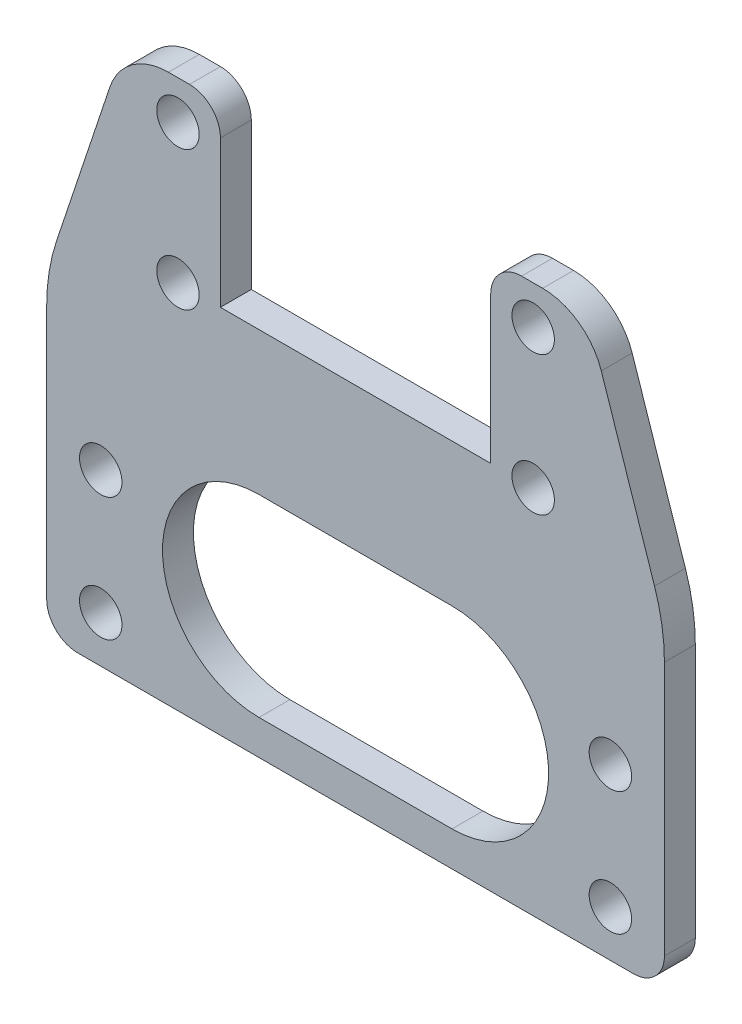
ISO-10303-21;
HEADER;
FILE_DESCRIPTION(('STEP AP214'),'2;1');
FILE_NAME('part.step','',(''),(''),'','','');
FILE_SCHEMA(('AUTOMOTIVE_DESIGN { 1 0 10303 214 1 1 1 1 }'));
ENDSEC;
DATA;
#1=APPLICATION_CONTEXT('core data for automotive mechanical design processes');
#2=APPLICATION_PROTOCOL_DEFINITION('international standard','automotive_design',2000,#1);
#3=PRODUCT_CONTEXT('',#1,'mechanical');
#4=PRODUCT('Part','Part','',(#3));
#5=PRODUCT_RELATED_PRODUCT_CATEGORY('part','',(#4));
#6=PRODUCT_DEFINITION_FORMATION('','',#4);
#7=PRODUCT_DEFINITION_CONTEXT('part definition',#1,'design');
#8=PRODUCT_DEFINITION('design','',#6,#7);
#9=PRODUCT_DEFINITION_SHAPE('','',#8);
#10=(LENGTH_UNIT() NAMED_UNIT(*) SI_UNIT(.MILLI.,.METRE.));
#11=(NAMED_UNIT(*) PLANE_ANGLE_UNIT() SI_UNIT($,.RADIAN.));
#12=(NAMED_UNIT(*) SI_UNIT($,.STERADIAN.) SOLID_ANGLE_UNIT());
#13=UNCERTAINTY_MEASURE_WITH_UNIT(LENGTH_MEASURE(1.E-05),#10,'distance_accuracy_value','');
#14=(GEOMETRIC_REPRESENTATION_CONTEXT(3) GLOBAL_UNCERTAINTY_ASSIGNED_CONTEXT((#13)) GLOBAL_UNIT_ASSIGNED_CONTEXT((#10,
#11,#12)) REPRESENTATION_CONTEXT('',''));
#15=CARTESIAN_POINT('',(0.,0.,0.));
#16=DIRECTION('',(0.,0.,1.));
#17=DIRECTION('',(1.,0.,0.));
#18=AXIS2_PLACEMENT_3D('',#15,#16,#17);
#19=CARTESIAN_POINT('',(18.,0.,4.));
#20=DIRECTION('',(0.,-1.,0.));
#21=DIRECTION('',(1.,0.,0.));
#22=AXIS2_PLACEMENT_3D('',#19,#20,#21);
#23=PLANE('',#22);
#24=DIRECTION('',(0.,0.,-1.));
#25=VECTOR('',#24,1.);
#26=CARTESIAN_POINT('',(-17.5,0.,4.));
#27=LINE('',#26,#25);
#28=CARTESIAN_POINT('',(-17.5,0.,4.));
#29=VERTEX_POINT('',#28);
#30=CARTESIAN_POINT('',(-17.5,0.,0.));
#31=VERTEX_POINT('',#30);
#32=EDGE_CURVE('E244',#29,#31,#27,.T.);
#33=ORIENTED_EDGE('',*,*,#32,.F.);
#34=DIRECTION('',(-1.,0.,0.));
#35=VECTOR('',#34,1.);
#36=CARTESIAN_POINT('',(18.,0.,4.));
#37=LINE('',#36,#35);
#38=CARTESIAN_POINT('',(17.5,0.,4.));
#39=VERTEX_POINT('',#38);
#40=EDGE_CURVE('E309',#39,#29,#37,.T.);
#41=ORIENTED_EDGE('',*,*,#40,.F.);
#42=DIRECTION('',(0.,0.,-1.));
#43=VECTOR('',#42,1.);
#44=CARTESIAN_POINT('',(17.5,0.,4.));
#45=LINE('',#44,#43);
#46=CARTESIAN_POINT('',(17.5,0.,0.));
#47=VERTEX_POINT('',#46);
#48=EDGE_CURVE('E258',#39,#47,#45,.T.);
#49=ORIENTED_EDGE('',*,*,#48,.T.);
#50=DIRECTION('',(-1.,0.,0.));
#51=VECTOR('',#50,1.);
#52=CARTESIAN_POINT('',(18.,0.,0.));
#53=LINE('',#52,#51);
#54=EDGE_CURVE('E302',#47,#31,#53,.T.);
#55=ORIENTED_EDGE('',*,*,#54,.T.);
#56=EDGE_LOOP('',(#33,#41,#49,#55));
#57=FACE_BOUND('',#56,.T.);
#58=ADVANCED_FACE('F33',(#57),#23,.F.);
#59=CARTESIAN_POINT('',(0.,0.,4.));
#60=DIRECTION('',(0.,0.,1.));
#61=DIRECTION('',(1.,0.,0.));
#62=AXIS2_PLACEMENT_3D('',#59,#60,#61);
#63=PLANE('',#62);
#64=CARTESIAN_POINT('',(-12.5,-31.,4.));
#65=DIRECTION('',(0.,0.,1.));
#66=DIRECTION('',(1.,0.,0.));
#67=AXIS2_PLACEMENT_3D('',#64,#65,#66);
#68=CIRCLE('',#67,12.5);
#69=CARTESIAN_POINT('',(-12.5,-18.5,4.));
#70=VERTEX_POINT('',#69);
#71=CARTESIAN_POINT('',(-12.5,-43.5,4.));
#72=VERTEX_POINT('',#71);
#73=EDGE_CURVE('E48',#70,#72,#68,.T.);
#74=ORIENTED_EDGE('',*,*,#73,.F.);
#75=DIRECTION('',(-1.,0.,0.));
#76=VECTOR('',#75,1.);
#77=CARTESIAN_POINT('',(-12.5,-18.5,4.));
#78=LINE('',#77,#76);
#79=CARTESIAN_POINT('',(12.5,-18.5,4.));
#80=VERTEX_POINT('',#79);
#81=EDGE_CURVE('E199',#80,#70,#78,.T.);
#82=ORIENTED_EDGE('',*,*,#81,.F.);
#83=CARTESIAN_POINT('',(12.5,-31.,4.));
#84=DIRECTION('',(0.,0.,1.));
#85=DIRECTION('',(1.,0.,0.));
#86=AXIS2_PLACEMENT_3D('',#83,#84,#85);
#87=CIRCLE('',#86,12.5);
#88=CARTESIAN_POINT('',(12.5,-43.5,4.));
#89=VERTEX_POINT('',#88);
#90=EDGE_CURVE('E202',#89,#80,#87,.T.);
#91=ORIENTED_EDGE('',*,*,#90,.F.);
#92=DIRECTION('',(1.,0.,0.));
#93=VECTOR('',#92,1.);
#94=CARTESIAN_POINT('',(-12.5,-43.5,4.));
#95=LINE('',#94,#93);
#96=EDGE_CURVE('E208',#72,#89,#95,.T.);
#97=ORIENTED_EDGE('',*,*,#96,.F.);
#98=EDGE_LOOP('',(#74,#82,#91,#97));
#99=FACE_BOUND('',#98,.T.);
#100=DIRECTION('',(0.,1.,0.));
#101=VECTOR('',#100,1.);
#102=CARTESIAN_POINT('',(40.,-7.00000000000001,4.));
#103=LINE('',#102,#101);
#104=CARTESIAN_POINT('',(40.,-44.,4.));
#105=VERTEX_POINT('',#104);
#106=CARTESIAN_POINT('',(40.,-11.0569415042095,4.));
#107=VERTEX_POINT('',#106);
#108=EDGE_CURVE('E304',#105,#107,#103,.T.);
#109=ORIENTED_EDGE('',*,*,#108,.T.);
#110=CARTESIAN_POINT('',(15.,-11.0569415042095,4.));
#111=DIRECTION('',(0.,0.,1.));
#112=DIRECTION('',(1.,0.,0.));
#113=AXIS2_PLACEMENT_3D('',#110,#111,#112);
#114=CIRCLE('',#113,25.);
#115=CARTESIAN_POINT('',(38.7170824512629,-3.15124735378857,4.));
#116=VERTEX_POINT('',#115);
#117=EDGE_CURVE('E393',#107,#116,#114,.T.);
#118=ORIENTED_EDGE('',*,*,#117,.T.);
#119=DIRECTION('',(-0.316227766016837,0.948683298050514,0.));
#120=VECTOR('',#119,1.);
#121=CARTESIAN_POINT('',(30.,23.,4.));
#122=LINE('',#121,#120);
#123=CARTESIAN_POINT('',(31.8233926239551,17.5298221281347,4.));
#124=VERTEX_POINT('',#123);
#125=EDGE_CURVE('E240',#116,#124,#122,.T.);
#126=ORIENTED_EDGE('',*,*,#125,.T.);
#127=CARTESIAN_POINT('',(24.233926239551,15.,4.));
#128=DIRECTION('',(0.,0.,1.));
#129=DIRECTION('',(1.,0.,0.));
#130=AXIS2_PLACEMENT_3D('',#127,#128,#129);
#131=CIRCLE('',#130,8.);
#132=CARTESIAN_POINT('',(24.233926239551,23.,4.));
#133=VERTEX_POINT('',#132);
#134=EDGE_CURVE('E375',#124,#133,#131,.T.);
#135=ORIENTED_EDGE('',*,*,#134,.T.);
#136=DIRECTION('',(-1.,0.,0.));
#137=VECTOR('',#136,1.);
#138=CARTESIAN_POINT('',(18.,23.,4.));
#139=LINE('',#138,#137);
#140=CARTESIAN_POINT('',(21.5,23.,4.));
#141=VERTEX_POINT('',#140);
#142=EDGE_CURVE('E307',#133,#141,#139,.T.);
#143=ORIENTED_EDGE('',*,*,#142,.T.);
#144=CARTESIAN_POINT('',(21.5,19.,4.));
#145=DIRECTION('',(0.,0.,1.));
#146=DIRECTION('',(1.,0.,0.));
#147=AXIS2_PLACEMENT_3D('',#144,#145,#146);
#148=CIRCLE('',#147,4.);
#149=CARTESIAN_POINT('',(17.5,19.,4.));
#150=VERTEX_POINT('',#149);
#151=EDGE_CURVE('E342',#141,#150,#148,.T.);
#152=ORIENTED_EDGE('',*,*,#151,.T.);
#153=DIRECTION('',(0.,-1.,0.));
#154=VECTOR('',#153,1.);
#155=CARTESIAN_POINT('',(17.5,0.,4.));
#156=LINE('',#155,#154);
#157=EDGE_CURVE('E242',#150,#39,#156,.T.);
#158=ORIENTED_EDGE('',*,*,#157,.T.);
#159=ORIENTED_EDGE('',*,*,#40,.T.);
#160=DIRECTION('',(0.,1.,0.));
#161=VECTOR('',#160,1.);
#162=CARTESIAN_POINT('',(-17.5,0.,4.));
#163=LINE('',#162,#161);
#164=CARTESIAN_POINT('',(-17.5,19.,4.));
#165=VERTEX_POINT('',#164);
#166=EDGE_CURVE('E230',#29,#165,#163,.T.);
#167=ORIENTED_EDGE('',*,*,#166,.T.);
#168=CARTESIAN_POINT('',(-21.5,19.,4.));
#169=DIRECTION('',(0.,0.,1.));
#170=DIRECTION('',(1.,0.,0.));
#171=AXIS2_PLACEMENT_3D('',#168,#169,#170);
#172=CIRCLE('',#171,4.);
#173=CARTESIAN_POINT('',(-21.5,23.,4.));
#174=VERTEX_POINT('',#173);
#175=EDGE_CURVE('E340',#165,#174,#172,.T.);
#176=ORIENTED_EDGE('',*,*,#175,.T.);
#177=DIRECTION('',(-1.,0.,0.));
#178=VECTOR('',#177,1.);
#179=CARTESIAN_POINT('',(-18.,23.,4.));
#180=LINE('',#179,#178);
#181=CARTESIAN_POINT('',(-24.233926239551,23.,4.));
#182=VERTEX_POINT('',#181);
#183=EDGE_CURVE('E298',#174,#182,#180,.T.);
#184=ORIENTED_EDGE('',*,*,#183,.T.);
#185=CARTESIAN_POINT('',(-24.233926239551,15.,4.));
#186=DIRECTION('',(0.,0.,1.));
#187=DIRECTION('',(1.,0.,0.));
#188=AXIS2_PLACEMENT_3D('',#185,#186,#187);
#189=CIRCLE('',#188,8.);
#190=CARTESIAN_POINT('',(-31.8233926239551,17.5298221281347,4.));
#191=VERTEX_POINT('',#190);
#192=EDGE_CURVE('E373',#182,#191,#189,.T.);
#193=ORIENTED_EDGE('',*,*,#192,.T.);
#194=DIRECTION('',(-0.316227766016837,-0.948683298050514,0.));
#195=VECTOR('',#194,1.);
#196=CARTESIAN_POINT('',(-30.,23.,4.));
#197=LINE('',#196,#195);
#198=CARTESIAN_POINT('',(-38.7170824512629,-3.15124735378858,4.));
#199=VERTEX_POINT('',#198);
#200=EDGE_CURVE('E233',#191,#199,#197,.T.);
#201=ORIENTED_EDGE('',*,*,#200,.T.);
#202=CARTESIAN_POINT('',(-15.,-11.0569415042095,4.));
#203=DIRECTION('',(0.,0.,1.));
#204=DIRECTION('',(1.,0.,0.));
#205=AXIS2_PLACEMENT_3D('',#202,#203,#204);
#206=CIRCLE('',#205,25.);
#207=CARTESIAN_POINT('',(-40.,-11.0569415042095,4.));
#208=VERTEX_POINT('',#207);
#209=EDGE_CURVE('E391',#199,#208,#206,.T.);
#210=ORIENTED_EDGE('',*,*,#209,.T.);
#211=DIRECTION('',(0.,-1.,0.));
#212=VECTOR('',#211,1.);
#213=CARTESIAN_POINT('',(-40.,-7.00000000000002,4.));
#214=LINE('',#213,#212);
#215=CARTESIAN_POINT('',(-40.,-44.,4.));
#216=VERTEX_POINT('',#215);
#217=EDGE_CURVE('E301',#208,#216,#214,.T.);
#218=ORIENTED_EDGE('',*,*,#217,.T.);
#219=CARTESIAN_POINT('',(-36.,-44.,4.));
#220=DIRECTION('',(0.,0.,1.));
#221=DIRECTION('',(1.,0.,0.));
#222=AXIS2_PLACEMENT_3D('',#219,#220,#221);
#223=CIRCLE('',#222,4.);
#224=CARTESIAN_POINT('',(-36.,-48.,4.));
#225=VERTEX_POINT('',#224);
#226=EDGE_CURVE('E344',#216,#225,#223,.T.);
#227=ORIENTED_EDGE('',*,*,#226,.T.);
#228=DIRECTION('',(1.,0.,0.));
#229=VECTOR('',#228,1.);
#230=CARTESIAN_POINT('',(-40.,-48.,4.));
#231=LINE('',#230,#229);
#232=CARTESIAN_POINT('',(36.,-48.,4.));
#233=VERTEX_POINT('',#232);
#234=EDGE_CURVE('E237',#225,#233,#231,.T.);
#235=ORIENTED_EDGE('',*,*,#234,.T.);
#236=CARTESIAN_POINT('',(36.,-44.,4.));
#237=DIRECTION('',(0.,0.,1.));
#238=DIRECTION('',(1.,0.,0.));
#239=AXIS2_PLACEMENT_3D('',#236,#237,#238);
#240=CIRCLE('',#239,4.);
#241=EDGE_CURVE('E346',#233,#105,#240,.T.);
#242=ORIENTED_EDGE('',*,*,#241,.T.);
#243=EDGE_LOOP('',(#109,#118,#126,#135,#143,#152,#158,#159,#167,#176,#184,#193,#201,#210,#218,
#227,#235,#242));
#244=FACE_BOUND('',#243,.T.);
#245=CARTESIAN_POINT('',(-33.,-26.,4.));
#246=DIRECTION('',(0.,0.,1.));
#247=DIRECTION('',(1.,0.,0.));
#248=AXIS2_PLACEMENT_3D('',#245,#246,#247);
#249=CIRCLE('',#248,2.75);
#250=CARTESIAN_POINT('',(-30.25,-26.,4.));
#251=VERTEX_POINT('',#250);
#252=EDGE_CURVE('E274',#251,#251,#249,.T.);
#253=ORIENTED_EDGE('',*,*,#252,.F.);
#254=EDGE_LOOP('',(#253));
#255=FACE_BOUND('',#254,.T.);
#256=CARTESIAN_POINT('',(-23.,0.,4.));
#257=DIRECTION('',(0.,0.,1.));
#258=DIRECTION('',(1.,0.,0.));
#259=AXIS2_PLACEMENT_3D('',#256,#257,#258);
#260=CIRCLE('',#259,2.75);
#261=CARTESIAN_POINT('',(-20.25,0.,4.));
#262=VERTEX_POINT('',#261);
#263=EDGE_CURVE('E286',#262,#262,#260,.T.);
#264=ORIENTED_EDGE('',*,*,#263,.F.);
#265=EDGE_LOOP('',(#264));
#266=FACE_BOUND('',#265,.T.);
#267=CARTESIAN_POINT('',(-23.,18.,4.));
#268=DIRECTION('',(0.,0.,1.));
#269=DIRECTION('',(1.,0.,0.));
#270=AXIS2_PLACEMENT_3D('',#267,#268,#269);
#271=CIRCLE('',#270,2.75);
#272=CARTESIAN_POINT('',(-20.25,18.,4.));
#273=VERTEX_POINT('',#272);
#274=EDGE_CURVE('E292',#273,#273,#271,.T.);
#275=ORIENTED_EDGE('',*,*,#274,.F.);
#276=EDGE_LOOP('',(#275));
#277=FACE_BOUND('',#276,.T.);
#278=CARTESIAN_POINT('',(33.,-26.,4.));
#279=DIRECTION('',(0.,0.,1.));
#280=DIRECTION('',(-1.,0.,0.));
#281=AXIS2_PLACEMENT_3D('',#278,#279,#280);
#282=CIRCLE('',#281,2.75);
#283=CARTESIAN_POINT('',(30.25,-26.,4.));
#284=VERTEX_POINT('',#283);
#285=EDGE_CURVE('E280',#284,#284,#282,.T.);
#286=ORIENTED_EDGE('',*,*,#285,.F.);
#287=EDGE_LOOP('',(#286));
#288=FACE_BOUND('',#287,.T.);
#289=CARTESIAN_POINT('',(23.,18.,4.));
#290=DIRECTION('',(0.,0.,1.));
#291=DIRECTION('',(-1.,0.,0.));
#292=AXIS2_PLACEMENT_3D('',#289,#290,#291);
#293=CIRCLE('',#292,2.75);
#294=CARTESIAN_POINT('',(20.25,18.,4.));
#295=VERTEX_POINT('',#294);
#296=EDGE_CURVE('E268',#295,#295,#293,.T.);
#297=ORIENTED_EDGE('',*,*,#296,.F.);
#298=EDGE_LOOP('',(#297));
#299=FACE_BOUND('',#298,.T.);
#300=CARTESIAN_POINT('',(23.,0.,4.));
#301=DIRECTION('',(0.,0.,1.));
#302=DIRECTION('',(-1.,0.,0.));
#303=AXIS2_PLACEMENT_3D('',#300,#301,#302);
#304=CIRCLE('',#303,2.75);
#305=CARTESIAN_POINT('',(20.25,0.,4.));
#306=VERTEX_POINT('',#305);
#307=EDGE_CURVE('E262',#306,#306,#304,.T.);
#308=ORIENTED_EDGE('',*,*,#307,.F.);
#309=EDGE_LOOP('',(#308));
#310=FACE_BOUND('',#309,.T.);
#311=CARTESIAN_POINT('',(33.,-42.,4.));
#312=DIRECTION('',(0.,0.,1.));
#313=DIRECTION('',(1.,0.,0.));
#314=AXIS2_PLACEMENT_3D('',#311,#312,#313);
#315=CIRCLE('',#314,2.74999999999999);
#316=CARTESIAN_POINT('',(35.75,-42.,4.));
#317=VERTEX_POINT('',#316);
#318=EDGE_CURVE('E218',#317,#317,#315,.T.);
#319=ORIENTED_EDGE('',*,*,#318,.F.);
#320=EDGE_LOOP('',(#319));
#321=FACE_BOUND('',#320,.T.);
#322=CARTESIAN_POINT('',(-33.,-42.,4.));
#323=DIRECTION('',(0.,0.,1.));
#324=DIRECTION('',(1.,0.,0.));
#325=AXIS2_PLACEMENT_3D('',#322,#323,#324);
#326=CIRCLE('',#325,2.75);
#327=CARTESIAN_POINT('',(-30.25,-42.,4.));
#328=VERTEX_POINT('',#327);
#329=EDGE_CURVE('E224',#328,#328,#326,.T.);
#330=ORIENTED_EDGE('',*,*,#329,.F.);
#331=EDGE_LOOP('',(#330));
#332=FACE_BOUND('',#331,.T.);
#333=ADVANCED_FACE('F413',(#99,#244,#255,#266,#277,#288,#299,#310,#321,#332),#63,.T.);
#334=CARTESIAN_POINT('',(0.,0.,0.));
#335=DIRECTION('',(0.,0.,1.));
#336=DIRECTION('',(1.,0.,0.));
#337=AXIS2_PLACEMENT_3D('',#334,#335,#336);
#338=PLANE('',#337);
#339=DIRECTION('',(-1.,0.,0.));
#340=VECTOR('',#339,1.);
#341=CARTESIAN_POINT('',(-12.5,-18.5,0.));
#342=LINE('',#341,#340);
#343=CARTESIAN_POINT('',(12.5,-18.5,0.));
#344=VERTEX_POINT('',#343);
#345=CARTESIAN_POINT('',(-12.5,-18.5,0.));
#346=VERTEX_POINT('',#345);
#347=EDGE_CURVE('E189',#344,#346,#342,.T.);
#348=ORIENTED_EDGE('',*,*,#347,.T.);
#349=CARTESIAN_POINT('',(-12.5,-31.,0.));
#350=DIRECTION('',(0.,0.,1.));
#351=DIRECTION('',(1.,0.,0.));
#352=AXIS2_PLACEMENT_3D('',#349,#350,#351);
#353=CIRCLE('',#352,12.5);
#354=CARTESIAN_POINT('',(-12.5,-43.5,0.));
#355=VERTEX_POINT('',#354);
#356=EDGE_CURVE('E183',#346,#355,#353,.T.);
#357=ORIENTED_EDGE('',*,*,#356,.T.);
#358=DIRECTION('',(1.,0.,0.));
#359=VECTOR('',#358,1.);
#360=CARTESIAN_POINT('',(-12.5,-43.5,0.));
#361=LINE('',#360,#359);
#362=CARTESIAN_POINT('',(12.5,-43.5,0.));
#363=VERTEX_POINT('',#362);
#364=EDGE_CURVE('E192',#355,#363,#361,.T.);
#365=ORIENTED_EDGE('',*,*,#364,.T.);
#366=CARTESIAN_POINT('',(12.5,-31.,0.));
#367=DIRECTION('',(0.,0.,1.));
#368=DIRECTION('',(1.,0.,0.));
#369=AXIS2_PLACEMENT_3D('',#366,#367,#368);
#370=CIRCLE('',#369,12.5);
#371=EDGE_CURVE('E56',#363,#344,#370,.T.);
#372=ORIENTED_EDGE('',*,*,#371,.T.);
#373=EDGE_LOOP('',(#348,#357,#365,#372));
#374=FACE_BOUND('',#373,.T.);
#375=DIRECTION('',(-0.316227766016837,0.948683298050514,0.));
#376=VECTOR('',#375,1.);
#377=CARTESIAN_POINT('',(30.,23.,0.));
#378=LINE('',#377,#376);
#379=CARTESIAN_POINT('',(38.7170824512629,-3.15124735378857,0.));
#380=VERTEX_POINT('',#379);
#381=CARTESIAN_POINT('',(31.8233926239551,17.5298221281347,0.));
#382=VERTEX_POINT('',#381);
#383=EDGE_CURVE('E253',#380,#382,#378,.T.);
#384=ORIENTED_EDGE('',*,*,#383,.F.);
#385=CARTESIAN_POINT('',(15.,-11.0569415042095,0.));
#386=DIRECTION('',(0.,0.,1.));
#387=DIRECTION('',(1.,0.,0.));
#388=AXIS2_PLACEMENT_3D('',#385,#386,#387);
#389=CIRCLE('',#388,25.);
#390=CARTESIAN_POINT('',(40.,-11.0569415042095,0.));
#391=VERTEX_POINT('',#390);
#392=EDGE_CURVE('E387',#380,#391,#389,.F.);
#393=ORIENTED_EDGE('',*,*,#392,.T.);
#394=DIRECTION('',(0.,1.,0.));
#395=VECTOR('',#394,1.);
#396=CARTESIAN_POINT('',(40.,-7.00000000000001,0.));
#397=LINE('',#396,#395);
#398=CARTESIAN_POINT('',(40.,-44.,0.));
#399=VERTEX_POINT('',#398);
#400=EDGE_CURVE('E317',#399,#391,#397,.T.);
#401=ORIENTED_EDGE('',*,*,#400,.F.);
#402=CARTESIAN_POINT('',(36.,-44.,0.));
#403=DIRECTION('',(0.,0.,1.));
#404=DIRECTION('',(1.,0.,0.));
#405=AXIS2_PLACEMENT_3D('',#402,#403,#404);
#406=CIRCLE('',#405,4.);
#407=CARTESIAN_POINT('',(36.,-48.,0.));
#408=VERTEX_POINT('',#407);
#409=EDGE_CURVE('E333',#399,#408,#406,.F.);
#410=ORIENTED_EDGE('',*,*,#409,.T.);
#411=DIRECTION('',(1.,0.,0.));
#412=VECTOR('',#411,1.);
#413=CARTESIAN_POINT('',(-40.,-48.,0.));
#414=LINE('',#413,#412);
#415=CARTESIAN_POINT('',(-36.,-48.,0.));
#416=VERTEX_POINT('',#415);
#417=EDGE_CURVE('E250',#416,#408,#414,.T.);
#418=ORIENTED_EDGE('',*,*,#417,.F.);
#419=CARTESIAN_POINT('',(-36.,-44.,0.));
#420=DIRECTION('',(0.,0.,1.));
#421=DIRECTION('',(1.,0.,0.));
#422=AXIS2_PLACEMENT_3D('',#419,#420,#421);
#423=CIRCLE('',#422,4.);
#424=CARTESIAN_POINT('',(-40.,-44.,0.));
#425=VERTEX_POINT('',#424);
#426=EDGE_CURVE('E330',#416,#425,#423,.F.);
#427=ORIENTED_EDGE('',*,*,#426,.T.);
#428=DIRECTION('',(0.,-1.,0.));
#429=VECTOR('',#428,1.);
#430=CARTESIAN_POINT('',(-40.,-7.00000000000002,0.));
#431=LINE('',#430,#429);
#432=CARTESIAN_POINT('',(-40.,-11.0569415042095,0.));
#433=VERTEX_POINT('',#432);
#434=EDGE_CURVE('E315',#433,#425,#431,.T.);
#435=ORIENTED_EDGE('',*,*,#434,.F.);
#436=CARTESIAN_POINT('',(-15.,-11.0569415042095,0.));
#437=DIRECTION('',(0.,0.,1.));
#438=DIRECTION('',(1.,0.,0.));
#439=AXIS2_PLACEMENT_3D('',#436,#437,#438);
#440=CIRCLE('',#439,25.);
#441=CARTESIAN_POINT('',(-38.7170824512629,-3.15124735378858,0.));
#442=VERTEX_POINT('',#441);
#443=EDGE_CURVE('E385',#433,#442,#440,.F.);
#444=ORIENTED_EDGE('',*,*,#443,.T.);
#445=DIRECTION('',(-0.316227766016837,-0.948683298050514,0.));
#446=VECTOR('',#445,1.);
#447=CARTESIAN_POINT('',(-30.,23.,0.));
#448=LINE('',#447,#446);
#449=CARTESIAN_POINT('',(-31.8233926239551,17.5298221281347,0.));
#450=VERTEX_POINT('',#449);
#451=EDGE_CURVE('E247',#450,#442,#448,.T.);
#452=ORIENTED_EDGE('',*,*,#451,.F.);
#453=CARTESIAN_POINT('',(-24.233926239551,15.,0.));
#454=DIRECTION('',(0.,0.,1.));
#455=DIRECTION('',(1.,0.,0.));
#456=AXIS2_PLACEMENT_3D('',#453,#454,#455);
#457=CIRCLE('',#456,8.);
#458=CARTESIAN_POINT('',(-24.233926239551,23.,0.));
#459=VERTEX_POINT('',#458);
#460=EDGE_CURVE('E365',#450,#459,#457,.F.);
#461=ORIENTED_EDGE('',*,*,#460,.T.);
#462=DIRECTION('',(-1.,0.,0.));
#463=VECTOR('',#462,1.);
#464=CARTESIAN_POINT('',(-18.,23.,0.));
#465=LINE('',#464,#463);
#466=CARTESIAN_POINT('',(-21.5,23.,0.));
#467=VERTEX_POINT('',#466);
#468=EDGE_CURVE('E295',#467,#459,#465,.T.);
#469=ORIENTED_EDGE('',*,*,#468,.F.);
#470=CARTESIAN_POINT('',(-21.5,19.,0.));
#471=DIRECTION('',(0.,0.,1.));
#472=DIRECTION('',(1.,0.,0.));
#473=AXIS2_PLACEMENT_3D('',#470,#471,#472);
#474=CIRCLE('',#473,4.);
#475=CARTESIAN_POINT('',(-17.5,19.,0.));
#476=VERTEX_POINT('',#475);
#477=EDGE_CURVE('E325',#467,#476,#474,.F.);
#478=ORIENTED_EDGE('',*,*,#477,.T.);
#479=DIRECTION('',(0.,1.,0.));
#480=VECTOR('',#479,1.);
#481=CARTESIAN_POINT('',(-17.5,0.,0.));
#482=LINE('',#481,#480);
#483=EDGE_CURVE('E227',#31,#476,#482,.T.);
#484=ORIENTED_EDGE('',*,*,#483,.F.);
#485=ORIENTED_EDGE('',*,*,#54,.F.);
#486=DIRECTION('',(0.,-1.,0.));
#487=VECTOR('',#486,1.);
#488=CARTESIAN_POINT('',(17.5,0.,0.));
#489=LINE('',#488,#487);
#490=CARTESIAN_POINT('',(17.5,19.,0.));
#491=VERTEX_POINT('',#490);
#492=EDGE_CURVE('E234',#491,#47,#489,.T.);
#493=ORIENTED_EDGE('',*,*,#492,.F.);
#494=CARTESIAN_POINT('',(21.5,19.,0.));
#495=DIRECTION('',(0.,0.,1.));
#496=DIRECTION('',(1.,0.,0.));
#497=AXIS2_PLACEMENT_3D('',#494,#495,#496);
#498=CIRCLE('',#497,4.);
#499=CARTESIAN_POINT('',(21.5,23.,0.));
#500=VERTEX_POINT('',#499);
#501=EDGE_CURVE('E327',#491,#500,#498,.F.);
#502=ORIENTED_EDGE('',*,*,#501,.T.);
#503=DIRECTION('',(-1.,0.,0.));
#504=VECTOR('',#503,1.);
#505=CARTESIAN_POINT('',(18.,23.,0.));
#506=LINE('',#505,#504);
#507=CARTESIAN_POINT('',(24.233926239551,23.,0.));
#508=VERTEX_POINT('',#507);
#509=EDGE_CURVE('E320',#508,#500,#506,.T.);
#510=ORIENTED_EDGE('',*,*,#509,.F.);
#511=CARTESIAN_POINT('',(24.233926239551,15.,0.));
#512=DIRECTION('',(0.,0.,1.));
#513=DIRECTION('',(1.,0.,0.));
#514=AXIS2_PLACEMENT_3D('',#511,#512,#513);
#515=CIRCLE('',#514,8.);
#516=EDGE_CURVE('E367',#508,#382,#515,.F.);
#517=ORIENTED_EDGE('',*,*,#516,.T.);
#518=EDGE_LOOP('',(#384,#393,#401,#410,#418,#427,#435,#444,#452,#461,#469,#478,#484,#485,#493,
#502,#510,#517));
#519=FACE_BOUND('',#518,.T.);
#520=CARTESIAN_POINT('',(-23.,18.,0.));
#521=DIRECTION('',(0.,0.,1.));
#522=DIRECTION('',(1.,0.,0.));
#523=AXIS2_PLACEMENT_3D('',#520,#521,#522);
#524=CIRCLE('',#523,2.75);
#525=CARTESIAN_POINT('',(-20.25,18.,0.));
#526=VERTEX_POINT('',#525);
#527=EDGE_CURVE('E289',#526,#526,#524,.T.);
#528=ORIENTED_EDGE('',*,*,#527,.T.);
#529=EDGE_LOOP('',(#528));
#530=FACE_BOUND('',#529,.T.);
#531=CARTESIAN_POINT('',(-23.,0.,0.));
#532=DIRECTION('',(0.,0.,1.));
#533=DIRECTION('',(1.,0.,0.));
#534=AXIS2_PLACEMENT_3D('',#531,#532,#533);
#535=CIRCLE('',#534,2.75);
#536=CARTESIAN_POINT('',(-20.25,0.,0.));
#537=VERTEX_POINT('',#536);
#538=EDGE_CURVE('E283',#537,#537,#535,.T.);
#539=ORIENTED_EDGE('',*,*,#538,.T.);
#540=EDGE_LOOP('',(#539));
#541=FACE_BOUND('',#540,.T.);
#542=CARTESIAN_POINT('',(33.,-26.,0.));
#543=DIRECTION('',(0.,0.,1.));
#544=DIRECTION('',(-1.,0.,0.));
#545=AXIS2_PLACEMENT_3D('',#542,#543,#544);
#546=CIRCLE('',#545,2.75);
#547=CARTESIAN_POINT('',(30.25,-26.,0.));
#548=VERTEX_POINT('',#547);
#549=EDGE_CURVE('E277',#548,#548,#546,.T.);
#550=ORIENTED_EDGE('',*,*,#549,.T.);
#551=EDGE_LOOP('',(#550));
#552=FACE_BOUND('',#551,.T.);
#553=CARTESIAN_POINT('',(-33.,-26.,0.));
#554=DIRECTION('',(0.,0.,1.));
#555=DIRECTION('',(1.,0.,0.));
#556=AXIS2_PLACEMENT_3D('',#553,#554,#555);
#557=CIRCLE('',#556,2.75);
#558=CARTESIAN_POINT('',(-30.25,-26.,0.));
#559=VERTEX_POINT('',#558);
#560=EDGE_CURVE('E271',#559,#559,#557,.T.);
#561=ORIENTED_EDGE('',*,*,#560,.T.);
#562=EDGE_LOOP('',(#561));
#563=FACE_BOUND('',#562,.T.);
#564=CARTESIAN_POINT('',(23.,18.,0.));
#565=DIRECTION('',(0.,0.,1.));
#566=DIRECTION('',(-1.,0.,0.));
#567=AXIS2_PLACEMENT_3D('',#564,#565,#566);
#568=CIRCLE('',#567,2.75);
#569=CARTESIAN_POINT('',(20.25,18.,0.));
#570=VERTEX_POINT('',#569);
#571=EDGE_CURVE('E265',#570,#570,#568,.T.);
#572=ORIENTED_EDGE('',*,*,#571,.T.);
#573=EDGE_LOOP('',(#572));
#574=FACE_BOUND('',#573,.T.);
#575=CARTESIAN_POINT('',(23.,0.,0.));
#576=DIRECTION('',(0.,0.,1.));
#577=DIRECTION('',(-1.,0.,0.));
#578=AXIS2_PLACEMENT_3D('',#575,#576,#577);
#579=CIRCLE('',#578,2.75);
#580=CARTESIAN_POINT('',(20.25,0.,0.));
#581=VERTEX_POINT('',#580);
#582=EDGE_CURVE('E261',#581,#581,#579,.T.);
#583=ORIENTED_EDGE('',*,*,#582,.T.);
#584=EDGE_LOOP('',(#583));
#585=FACE_BOUND('',#584,.T.);
#586=CARTESIAN_POINT('',(-33.,-42.,0.));
#587=DIRECTION('',(0.,0.,1.));
#588=DIRECTION('',(1.,0.,0.));
#589=AXIS2_PLACEMENT_3D('',#586,#587,#588);
#590=CIRCLE('',#589,2.75);
#591=CARTESIAN_POINT('',(-30.25,-42.,0.));
#592=VERTEX_POINT('',#591);
#593=EDGE_CURVE('E221',#592,#592,#590,.T.);
#594=ORIENTED_EDGE('',*,*,#593,.T.);
#595=EDGE_LOOP('',(#594));
#596=FACE_BOUND('',#595,.T.);
#597=CARTESIAN_POINT('',(33.,-42.,0.));
#598=DIRECTION('',(0.,0.,1.));
#599=DIRECTION('',(1.,0.,0.));
#600=AXIS2_PLACEMENT_3D('',#597,#598,#599);
#601=CIRCLE('',#600,2.74999999999999);
#602=CARTESIAN_POINT('',(35.75,-42.,0.));
#603=VERTEX_POINT('',#602);
#604=EDGE_CURVE('E214',#603,#603,#601,.T.);
#605=ORIENTED_EDGE('',*,*,#604,.T.);
#606=EDGE_LOOP('',(#605));
#607=FACE_BOUND('',#606,.T.);
#608=ADVANCED_FACE('F196',(#374,#519,#530,#541,#552,#563,#574,#585,#596,#607),#338,.F.);
#609=CARTESIAN_POINT('',(-18.,23.,4.));
#610=DIRECTION('',(0.,-1.,0.));
#611=DIRECTION('',(0.,0.,-1.));
#612=AXIS2_PLACEMENT_3D('',#609,#610,#611);
#613=PLANE('',#612);
#614=ORIENTED_EDGE('',*,*,#468,.T.);
#615=DIRECTION('',(0.,0.,-1.));
#616=VECTOR('',#615,1.);
#617=CARTESIAN_POINT('',(-24.233926239551,23.,4.));
#618=LINE('',#617,#616);
#619=EDGE_CURVE('E380',#459,#182,#618,.F.);
#620=ORIENTED_EDGE('',*,*,#619,.T.);
#621=ORIENTED_EDGE('',*,*,#183,.F.);
#622=DIRECTION('',(0.,0.,-1.));
#623=VECTOR('',#622,1.);
#624=CARTESIAN_POINT('',(-21.5,23.,4.));
#625=LINE('',#624,#623);
#626=EDGE_CURVE('E357',#174,#467,#625,.T.);
#627=ORIENTED_EDGE('',*,*,#626,.T.);
#628=EDGE_LOOP('',(#614,#620,#621,#627));
#629=FACE_BOUND('',#628,.T.);
#630=ADVANCED_FACE('F469',(#629),#613,.F.);
#631=CARTESIAN_POINT('',(-40.,-7.00000000000002,4.));
#632=DIRECTION('',(1.,0.,0.));
#633=DIRECTION('',(0.,0.,-1.));
#634=AXIS2_PLACEMENT_3D('',#631,#632,#633);
#635=PLANE('',#634);
#636=ORIENTED_EDGE('',*,*,#217,.F.);
#637=DIRECTION('',(0.,0.,-1.));
#638=VECTOR('',#637,1.);
#639=CARTESIAN_POINT('',(-40.,-11.0569415042095,4.));
#640=LINE('',#639,#638);
#641=EDGE_CURVE('E41',#208,#433,#640,.T.);
#642=ORIENTED_EDGE('',*,*,#641,.T.);
#643=ORIENTED_EDGE('',*,*,#434,.T.);
#644=DIRECTION('',(0.,0.,-1.));
#645=VECTOR('',#644,1.);
#646=CARTESIAN_POINT('',(-40.,-44.,4.));
#647=LINE('',#646,#645);
#648=EDGE_CURVE('E348',#425,#216,#647,.F.);
#649=ORIENTED_EDGE('',*,*,#648,.T.);
#650=EDGE_LOOP('',(#636,#642,#643,#649));
#651=FACE_BOUND('',#650,.T.);
#652=ADVANCED_FACE('F399',(#651),#635,.F.);
#653=CARTESIAN_POINT('',(40.,-7.00000000000001,4.));
#654=DIRECTION('',(-1.,0.,0.));
#655=DIRECTION('',(0.,-1.,0.));
#656=AXIS2_PLACEMENT_3D('',#653,#654,#655);
#657=PLANE('',#656);
#658=ORIENTED_EDGE('',*,*,#400,.T.);
#659=DIRECTION('',(0.,0.,-1.));
#660=VECTOR('',#659,1.);
#661=CARTESIAN_POINT('',(40.,-11.0569415042095,4.));
#662=LINE('',#661,#660);
#663=EDGE_CURVE('E389',#391,#107,#662,.F.);
#664=ORIENTED_EDGE('',*,*,#663,.T.);
#665=ORIENTED_EDGE('',*,*,#108,.F.);
#666=DIRECTION('',(0.,0.,-1.));
#667=VECTOR('',#666,1.);
#668=CARTESIAN_POINT('',(40.,-44.,4.));
#669=LINE('',#668,#667);
#670=EDGE_CURVE('E312',#105,#399,#669,.T.);
#671=ORIENTED_EDGE('',*,*,#670,.T.);
#672=EDGE_LOOP('',(#658,#664,#665,#671));
#673=FACE_BOUND('',#672,.T.);
#674=ADVANCED_FACE('F425',(#673),#657,.F.);
#675=CARTESIAN_POINT('',(18.,23.,4.));
#676=DIRECTION('',(0.,-1.,0.));
#677=DIRECTION('',(1.,0.,0.));
#678=AXIS2_PLACEMENT_3D('',#675,#676,#677);
#679=PLANE('',#678);
#680=ORIENTED_EDGE('',*,*,#142,.F.);
#681=DIRECTION('',(0.,0.,-1.));
#682=VECTOR('',#681,1.);
#683=CARTESIAN_POINT('',(24.233926239551,23.,4.));
#684=LINE('',#683,#682);
#685=EDGE_CURVE('E362',#133,#508,#684,.T.);
#686=ORIENTED_EDGE('',*,*,#685,.T.);
#687=ORIENTED_EDGE('',*,*,#509,.T.);
#688=DIRECTION('',(0.,0.,-1.));
#689=VECTOR('',#688,1.);
#690=CARTESIAN_POINT('',(21.5,23.,4.));
#691=LINE('',#690,#689);
#692=EDGE_CURVE('E354',#500,#141,#691,.F.);
#693=ORIENTED_EDGE('',*,*,#692,.T.);
#694=EDGE_LOOP('',(#680,#686,#687,#693));
#695=FACE_BOUND('',#694,.T.);
#696=ADVANCED_FACE('F441',(#695),#679,.F.);
#697=CARTESIAN_POINT('',(-23.,18.,4.));
#698=DIRECTION('',(0.,0.,-1.));
#699=DIRECTION('',(-1.,0.,0.));
#700=AXIS2_PLACEMENT_3D('',#697,#698,#699);
#701=CYLINDRICAL_SURFACE('',#700,2.75);
#702=ORIENTED_EDGE('',*,*,#274,.T.);
#703=EDGE_LOOP('',(#702));
#704=FACE_BOUND('',#703,.T.);
#705=ORIENTED_EDGE('',*,*,#527,.F.);
#706=EDGE_LOOP('',(#705));
#707=FACE_BOUND('',#706,.T.);
#708=ADVANCED_FACE('F497',(#704,#707),#701,.F.);
#709=CARTESIAN_POINT('',(-23.,0.,4.));
#710=DIRECTION('',(0.,0.,-1.));
#711=DIRECTION('',(-1.,0.,0.));
#712=AXIS2_PLACEMENT_3D('',#709,#710,#711);
#713=CYLINDRICAL_SURFACE('',#712,2.75);
#714=ORIENTED_EDGE('',*,*,#263,.T.);
#715=EDGE_LOOP('',(#714));
#716=FACE_BOUND('',#715,.T.);
#717=ORIENTED_EDGE('',*,*,#538,.F.);
#718=EDGE_LOOP('',(#717));
#719=FACE_BOUND('',#718,.T.);
#720=ADVANCED_FACE('F610',(#716,#719),#713,.F.);
#721=CARTESIAN_POINT('',(33.,-26.,4.));
#722=DIRECTION('',(0.,0.,-1.));
#723=DIRECTION('',(-1.,0.,0.));
#724=AXIS2_PLACEMENT_3D('',#721,#722,#723);
#725=CYLINDRICAL_SURFACE('',#724,2.75);
#726=ORIENTED_EDGE('',*,*,#285,.T.);
#727=EDGE_LOOP('',(#726));
#728=FACE_BOUND('',#727,.T.);
#729=ORIENTED_EDGE('',*,*,#549,.F.);
#730=EDGE_LOOP('',(#729));
#731=FACE_BOUND('',#730,.T.);
#732=ADVANCED_FACE('F606',(#728,#731),#725,.F.);
#733=CARTESIAN_POINT('',(-33.,-26.,4.));
#734=DIRECTION('',(0.,0.,-1.));
#735=DIRECTION('',(-1.,0.,0.));
#736=AXIS2_PLACEMENT_3D('',#733,#734,#735);
#737=CYLINDRICAL_SURFACE('',#736,2.75);
#738=ORIENTED_EDGE('',*,*,#252,.T.);
#739=EDGE_LOOP('',(#738));
#740=FACE_BOUND('',#739,.T.);
#741=ORIENTED_EDGE('',*,*,#560,.F.);
#742=EDGE_LOOP('',(#741));
#743=FACE_BOUND('',#742,.T.);
#744=ADVANCED_FACE('F602',(#740,#743),#737,.F.);
#745=CARTESIAN_POINT('',(23.,18.,4.));
#746=DIRECTION('',(0.,0.,-1.));
#747=DIRECTION('',(-1.,0.,0.));
#748=AXIS2_PLACEMENT_3D('',#745,#746,#747);
#749=CYLINDRICAL_SURFACE('',#748,2.75);
#750=ORIENTED_EDGE('',*,*,#296,.T.);
#751=EDGE_LOOP('',(#750));
#752=FACE_BOUND('',#751,.T.);
#753=ORIENTED_EDGE('',*,*,#571,.F.);
#754=EDGE_LOOP('',(#753));
#755=FACE_BOUND('',#754,.T.);
#756=ADVANCED_FACE('F598',(#752,#755),#749,.F.);
#757=CARTESIAN_POINT('',(23.,0.,4.));
#758=DIRECTION('',(0.,0.,-1.));
#759=DIRECTION('',(-1.,0.,0.));
#760=AXIS2_PLACEMENT_3D('',#757,#758,#759);
#761=CYLINDRICAL_SURFACE('',#760,2.75);
#762=ORIENTED_EDGE('',*,*,#307,.T.);
#763=EDGE_LOOP('',(#762));
#764=FACE_BOUND('',#763,.T.);
#765=ORIENTED_EDGE('',*,*,#582,.F.);
#766=EDGE_LOOP('',(#765));
#767=FACE_BOUND('',#766,.T.);
#768=ADVANCED_FACE('F588',(#764,#767),#761,.F.);
#769=CARTESIAN_POINT('',(17.5,0.,4.));
#770=DIRECTION('',(1.,0.,0.));
#771=DIRECTION('',(0.,1.,0.));
#772=AXIS2_PLACEMENT_3D('',#769,#770,#771);
#773=PLANE('',#772);
#774=ORIENTED_EDGE('',*,*,#157,.F.);
#775=DIRECTION('',(0.,0.,-1.));
#776=VECTOR('',#775,1.);
#777=CARTESIAN_POINT('',(17.5,19.,4.));
#778=LINE('',#777,#776);
#779=EDGE_CURVE('E351',#150,#491,#778,.T.);
#780=ORIENTED_EDGE('',*,*,#779,.T.);
#781=ORIENTED_EDGE('',*,*,#492,.T.);
#782=ORIENTED_EDGE('',*,*,#48,.F.);
#783=EDGE_LOOP('',(#774,#780,#781,#782));
#784=FACE_BOUND('',#783,.T.);
#785=ADVANCED_FACE('F452',(#784),#773,.F.);
#786=CARTESIAN_POINT('',(-17.5,0.,4.));
#787=DIRECTION('',(-1.,0.,0.));
#788=DIRECTION('',(0.,0.,1.));
#789=AXIS2_PLACEMENT_3D('',#786,#787,#788);
#790=PLANE('',#789);
#791=ORIENTED_EDGE('',*,*,#483,.T.);
#792=DIRECTION('',(0.,0.,-1.));
#793=VECTOR('',#792,1.);
#794=CARTESIAN_POINT('',(-17.5,19.,4.));
#795=LINE('',#794,#793);
#796=EDGE_CURVE('E360',#476,#165,#795,.F.);
#797=ORIENTED_EDGE('',*,*,#796,.T.);
#798=ORIENTED_EDGE('',*,*,#166,.F.);
#799=ORIENTED_EDGE('',*,*,#32,.T.);
#800=EDGE_LOOP('',(#791,#797,#798,#799));
#801=FACE_BOUND('',#800,.T.);
#802=ADVANCED_FACE('F460',(#801),#790,.F.);
#803=CARTESIAN_POINT('',(30.,23.,4.));
#804=DIRECTION('',(-0.948683298050514,-0.316227766016837,0.));
#805=DIRECTION('',(0.316227766016837,-0.948683298050514,0.));
#806=AXIS2_PLACEMENT_3D('',#803,#804,#805);
#807=PLANE('',#806);
#808=ORIENTED_EDGE('',*,*,#125,.F.);
#809=DIRECTION('',(0.,0.,-1.));
#810=VECTOR('',#809,1.);
#811=CARTESIAN_POINT('',(38.7170824512629,-3.15124735378856,4.));
#812=LINE('',#811,#810);
#813=EDGE_CURVE('E382',#116,#380,#812,.T.);
#814=ORIENTED_EDGE('',*,*,#813,.T.);
#815=ORIENTED_EDGE('',*,*,#383,.T.);
#816=DIRECTION('',(0.,0.,-1.));
#817=VECTOR('',#816,1.);
#818=CARTESIAN_POINT('',(31.8233926239551,17.5298221281347,4.));
#819=LINE('',#818,#817);
#820=EDGE_CURVE('E370',#382,#124,#819,.F.);
#821=ORIENTED_EDGE('',*,*,#820,.T.);
#822=EDGE_LOOP('',(#808,#814,#815,#821));
#823=FACE_BOUND('',#822,.T.);
#824=ADVANCED_FACE('F433',(#823),#807,.F.);
#825=CARTESIAN_POINT('',(33.,-42.,4.));
#826=DIRECTION('',(0.,0.,-1.));
#827=DIRECTION('',(-1.,0.,0.));
#828=AXIS2_PLACEMENT_3D('',#825,#826,#827);
#829=CYLINDRICAL_SURFACE('',#828,2.74999999999999);
#830=ORIENTED_EDGE('',*,*,#318,.T.);
#831=EDGE_LOOP('',(#830));
#832=FACE_BOUND('',#831,.T.);
#833=ORIENTED_EDGE('',*,*,#604,.F.);
#834=EDGE_LOOP('',(#833));
#835=FACE_BOUND('',#834,.T.);
#836=ADVANCED_FACE('F578',(#832,#835),#829,.F.);
#837=CARTESIAN_POINT('',(-33.,-42.,4.));
#838=DIRECTION('',(0.,0.,-1.));
#839=DIRECTION('',(-1.,0.,0.));
#840=AXIS2_PLACEMENT_3D('',#837,#838,#839);
#841=CYLINDRICAL_SURFACE('',#840,2.75);
#842=ORIENTED_EDGE('',*,*,#329,.T.);
#843=EDGE_LOOP('',(#842));
#844=FACE_BOUND('',#843,.T.);
#845=ORIENTED_EDGE('',*,*,#593,.F.);
#846=EDGE_LOOP('',(#845));
#847=FACE_BOUND('',#846,.T.);
#848=ADVANCED_FACE('F581',(#844,#847),#841,.F.);
#849=CARTESIAN_POINT('',(-40.,-48.,4.));
#850=DIRECTION('',(0.,1.,0.));
#851=DIRECTION('',(-1.,0.,0.));
#852=AXIS2_PLACEMENT_3D('',#849,#850,#851);
#853=PLANE('',#852);
#854=ORIENTED_EDGE('',*,*,#417,.T.);
#855=DIRECTION('',(0.,0.,-1.));
#856=VECTOR('',#855,1.);
#857=CARTESIAN_POINT('',(36.,-48.,4.));
#858=LINE('',#857,#856);
#859=EDGE_CURVE('E338',#408,#233,#858,.F.);
#860=ORIENTED_EDGE('',*,*,#859,.T.);
#861=ORIENTED_EDGE('',*,*,#234,.F.);
#862=DIRECTION('',(0.,0.,-1.));
#863=VECTOR('',#862,1.);
#864=CARTESIAN_POINT('',(-36.,-48.,4.));
#865=LINE('',#864,#863);
#866=EDGE_CURVE('E335',#225,#416,#865,.T.);
#867=ORIENTED_EDGE('',*,*,#866,.T.);
#868=EDGE_LOOP('',(#854,#860,#861,#867));
#869=FACE_BOUND('',#868,.T.);
#870=ADVANCED_FACE('F417',(#869),#853,.F.);
#871=CARTESIAN_POINT('',(-30.,23.,4.));
#872=DIRECTION('',(0.948683298050514,-0.316227766016837,0.));
#873=DIRECTION('',(0.316227766016837,0.948683298050514,0.));
#874=AXIS2_PLACEMENT_3D('',#871,#872,#873);
#875=PLANE('',#874);
#876=ORIENTED_EDGE('',*,*,#451,.T.);
#877=DIRECTION('',(0.,0.,-1.));
#878=VECTOR('',#877,1.);
#879=CARTESIAN_POINT('',(-38.7170824512628,-3.15124735378856,4.));
#880=LINE('',#879,#878);
#881=EDGE_CURVE('E11',#442,#199,#880,.F.);
#882=ORIENTED_EDGE('',*,*,#881,.T.);
#883=ORIENTED_EDGE('',*,*,#200,.F.);
#884=DIRECTION('',(0.,0.,-1.));
#885=VECTOR('',#884,1.);
#886=CARTESIAN_POINT('',(-31.8233926239551,17.5298221281347,4.));
#887=LINE('',#886,#885);
#888=EDGE_CURVE('E377',#191,#450,#887,.T.);
#889=ORIENTED_EDGE('',*,*,#888,.T.);
#890=EDGE_LOOP('',(#876,#882,#883,#889));
#891=FACE_BOUND('',#890,.T.);
#892=ADVANCED_FACE('F476',(#891),#875,.F.);
#893=CARTESIAN_POINT('',(36.,-44.,4.));
#894=DIRECTION('',(0.,0.,-1.));
#895=DIRECTION('',(-1.,0.,0.));
#896=AXIS2_PLACEMENT_3D('',#893,#894,#895);
#897=CYLINDRICAL_SURFACE('',#896,4.);
#898=ORIENTED_EDGE('',*,*,#241,.F.);
#899=ORIENTED_EDGE('',*,*,#859,.F.);
#900=ORIENTED_EDGE('',*,*,#409,.F.);
#901=ORIENTED_EDGE('',*,*,#670,.F.);
#902=EDGE_LOOP('',(#898,#899,#900,#901));
#903=FACE_BOUND('',#902,.T.);
#904=ADVANCED_FACE('F420',(#903),#897,.T.);
#905=CARTESIAN_POINT('',(-36.,-44.,4.));
#906=DIRECTION('',(0.,0.,-1.));
#907=DIRECTION('',(-1.,0.,0.));
#908=AXIS2_PLACEMENT_3D('',#905,#906,#907);
#909=CYLINDRICAL_SURFACE('',#908,4.);
#910=ORIENTED_EDGE('',*,*,#226,.F.);
#911=ORIENTED_EDGE('',*,*,#648,.F.);
#912=ORIENTED_EDGE('',*,*,#426,.F.);
#913=ORIENTED_EDGE('',*,*,#866,.F.);
#914=EDGE_LOOP('',(#910,#911,#912,#913));
#915=FACE_BOUND('',#914,.T.);
#916=ADVANCED_FACE('F410',(#915),#909,.T.);
#917=CARTESIAN_POINT('',(21.5,19.,4.));
#918=DIRECTION('',(0.,0.,-1.));
#919=DIRECTION('',(-1.,0.,0.));
#920=AXIS2_PLACEMENT_3D('',#917,#918,#919);
#921=CYLINDRICAL_SURFACE('',#920,4.);
#922=ORIENTED_EDGE('',*,*,#151,.F.);
#923=ORIENTED_EDGE('',*,*,#692,.F.);
#924=ORIENTED_EDGE('',*,*,#501,.F.);
#925=ORIENTED_EDGE('',*,*,#779,.F.);
#926=EDGE_LOOP('',(#922,#923,#924,#925));
#927=FACE_BOUND('',#926,.T.);
#928=ADVANCED_FACE('F447',(#927),#921,.T.);
#929=CARTESIAN_POINT('',(-21.5,19.,4.));
#930=DIRECTION('',(0.,0.,-1.));
#931=DIRECTION('',(-1.,0.,0.));
#932=AXIS2_PLACEMENT_3D('',#929,#930,#931);
#933=CYLINDRICAL_SURFACE('',#932,4.);
#934=ORIENTED_EDGE('',*,*,#175,.F.);
#935=ORIENTED_EDGE('',*,*,#796,.F.);
#936=ORIENTED_EDGE('',*,*,#477,.F.);
#937=ORIENTED_EDGE('',*,*,#626,.F.);
#938=EDGE_LOOP('',(#934,#935,#936,#937));
#939=FACE_BOUND('',#938,.T.);
#940=ADVANCED_FACE('F464',(#939),#933,.T.);
#941=CARTESIAN_POINT('',(24.233926239551,15.,4.));
#942=DIRECTION('',(0.,0.,-1.));
#943=DIRECTION('',(-1.,0.,0.));
#944=AXIS2_PLACEMENT_3D('',#941,#942,#943);
#945=CYLINDRICAL_SURFACE('',#944,8.);
#946=ORIENTED_EDGE('',*,*,#134,.F.);
#947=ORIENTED_EDGE('',*,*,#820,.F.);
#948=ORIENTED_EDGE('',*,*,#516,.F.);
#949=ORIENTED_EDGE('',*,*,#685,.F.);
#950=EDGE_LOOP('',(#946,#947,#948,#949));
#951=FACE_BOUND('',#950,.T.);
#952=ADVANCED_FACE('F438',(#951),#945,.T.);
#953=CARTESIAN_POINT('',(-24.233926239551,15.,4.));
#954=DIRECTION('',(0.,0.,-1.));
#955=DIRECTION('',(-1.,0.,0.));
#956=AXIS2_PLACEMENT_3D('',#953,#954,#955);
#957=CYLINDRICAL_SURFACE('',#956,8.);
#958=ORIENTED_EDGE('',*,*,#192,.F.);
#959=ORIENTED_EDGE('',*,*,#619,.F.);
#960=ORIENTED_EDGE('',*,*,#460,.F.);
#961=ORIENTED_EDGE('',*,*,#888,.F.);
#962=EDGE_LOOP('',(#958,#959,#960,#961));
#963=FACE_BOUND('',#962,.T.);
#964=ADVANCED_FACE('F472',(#963),#957,.T.);
#965=CARTESIAN_POINT('',(15.,-11.0569415042095,4.));
#966=DIRECTION('',(0.,0.,-1.));
#967=DIRECTION('',(-1.,0.,0.));
#968=AXIS2_PLACEMENT_3D('',#965,#966,#967);
#969=CYLINDRICAL_SURFACE('',#968,25.);
#970=ORIENTED_EDGE('',*,*,#117,.F.);
#971=ORIENTED_EDGE('',*,*,#663,.F.);
#972=ORIENTED_EDGE('',*,*,#392,.F.);
#973=ORIENTED_EDGE('',*,*,#813,.F.);
#974=EDGE_LOOP('',(#970,#971,#972,#973));
#975=FACE_BOUND('',#974,.T.);
#976=ADVANCED_FACE('F429',(#975),#969,.T.);
#977=CARTESIAN_POINT('',(-15.,-11.0569415042095,4.));
#978=DIRECTION('',(0.,0.,-1.));
#979=DIRECTION('',(-1.,0.,0.));
#980=AXIS2_PLACEMENT_3D('',#977,#978,#979);
#981=CYLINDRICAL_SURFACE('',#980,25.);
#982=ORIENTED_EDGE('',*,*,#209,.F.);
#983=ORIENTED_EDGE('',*,*,#881,.F.);
#984=ORIENTED_EDGE('',*,*,#443,.F.);
#985=ORIENTED_EDGE('',*,*,#641,.F.);
#986=EDGE_LOOP('',(#982,#983,#984,#985));
#987=FACE_BOUND('',#986,.T.);
#988=ADVANCED_FACE('F35',(#987),#981,.T.);
#989=CARTESIAN_POINT('',(-12.5,-31.,0.));
#990=DIRECTION('',(0.,0.,1.));
#991=DIRECTION('',(1.,0.,0.));
#992=AXIS2_PLACEMENT_3D('',#989,#990,#991);
#993=CYLINDRICAL_SURFACE('',#992,12.5);
#994=ORIENTED_EDGE('',*,*,#73,.T.);
#995=DIRECTION('',(0.,0.,1.));
#996=VECTOR('',#995,1.);
#997=CARTESIAN_POINT('',(-12.5,-43.5,0.));
#998=LINE('',#997,#996);
#999=EDGE_CURVE('E179',#355,#72,#998,.T.);
#1000=ORIENTED_EDGE('',*,*,#999,.F.);
#1001=ORIENTED_EDGE('',*,*,#356,.F.);
#1002=DIRECTION('',(0.,0.,1.));
#1003=VECTOR('',#1002,1.);
#1004=CARTESIAN_POINT('',(-12.5,-18.5,0.));
#1005=LINE('',#1004,#1003);
#1006=EDGE_CURVE('E212',#346,#70,#1005,.T.);
#1007=ORIENTED_EDGE('',*,*,#1006,.T.);
#1008=EDGE_LOOP('',(#994,#1000,#1001,#1007));
#1009=FACE_BOUND('',#1008,.T.);
#1010=ADVANCED_FACE('F181',(#1009),#993,.F.);
#1011=CARTESIAN_POINT('',(-12.5,-18.5,0.));
#1012=DIRECTION('',(0.,1.,0.));
#1013=DIRECTION('',(0.,0.,1.));
#1014=AXIS2_PLACEMENT_3D('',#1011,#1012,#1013);
#1015=PLANE('',#1014);
#1016=ORIENTED_EDGE('',*,*,#81,.T.);
#1017=ORIENTED_EDGE('',*,*,#1006,.F.);
#1018=ORIENTED_EDGE('',*,*,#347,.F.);
#1019=DIRECTION('',(0.,0.,1.));
#1020=VECTOR('',#1019,1.);
#1021=CARTESIAN_POINT('',(12.5,-18.5,0.));
#1022=LINE('',#1021,#1020);
#1023=EDGE_CURVE('E215',#344,#80,#1022,.T.);
#1024=ORIENTED_EDGE('',*,*,#1023,.T.);
#1025=EDGE_LOOP('',(#1016,#1017,#1018,#1024));
#1026=FACE_BOUND('',#1025,.T.);
#1027=ADVANCED_FACE('F483',(#1026),#1015,.F.);
#1028=CARTESIAN_POINT('',(12.5,-31.,0.));
#1029=DIRECTION('',(0.,0.,1.));
#1030=DIRECTION('',(1.,0.,0.));
#1031=AXIS2_PLACEMENT_3D('',#1028,#1029,#1030);
#1032=CYLINDRICAL_SURFACE('',#1031,12.5);
#1033=ORIENTED_EDGE('',*,*,#90,.T.);
#1034=ORIENTED_EDGE('',*,*,#1023,.F.);
#1035=ORIENTED_EDGE('',*,*,#371,.F.);
#1036=DIRECTION('',(0.,0.,1.));
#1037=VECTOR('',#1036,1.);
#1038=CARTESIAN_POINT('',(12.5,-43.5,0.));
#1039=LINE('',#1038,#1037);
#1040=EDGE_CURVE('E188',#363,#89,#1039,.T.);
#1041=ORIENTED_EDGE('',*,*,#1040,.T.);
#1042=EDGE_LOOP('',(#1033,#1034,#1035,#1041));
#1043=FACE_BOUND('',#1042,.T.);
#1044=ADVANCED_FACE('F556',(#1043),#1032,.F.);
#1045=CARTESIAN_POINT('',(-12.5,-43.5,0.));
#1046=DIRECTION('',(0.,-1.,0.));
#1047=DIRECTION('',(0.,0.,-1.));
#1048=AXIS2_PLACEMENT_3D('',#1045,#1046,#1047);
#1049=PLANE('',#1048);
#1050=ORIENTED_EDGE('',*,*,#96,.T.);
#1051=ORIENTED_EDGE('',*,*,#1040,.F.);
#1052=ORIENTED_EDGE('',*,*,#364,.F.);
#1053=ORIENTED_EDGE('',*,*,#999,.T.);
#1054=EDGE_LOOP('',(#1050,#1051,#1052,#1053));
#1055=FACE_BOUND('',#1054,.T.);
#1056=ADVANCED_FACE('F193',(#1055),#1049,.F.);
#1057=CLOSED_SHELL('',(#58,#333,#608,#630,#652,#674,#696,#708,#720,#732,#744,#756,#768,#785,
#802,#824,#836,#848,#870,#892,#904,#916,#928,#940,#952,#964,#976,#988,#1010,#1027,#1044,#1056));
#1058=MANIFOLD_SOLID_BREP('B2',#1057);
#1059=ADVANCED_BREP_SHAPE_REPRESENTATION('',(#18,#1058),#14);
#1060=SHAPE_DEFINITION_REPRESENTATION(#9,#1059);
ENDSEC;
END-ISO-10303-21;
